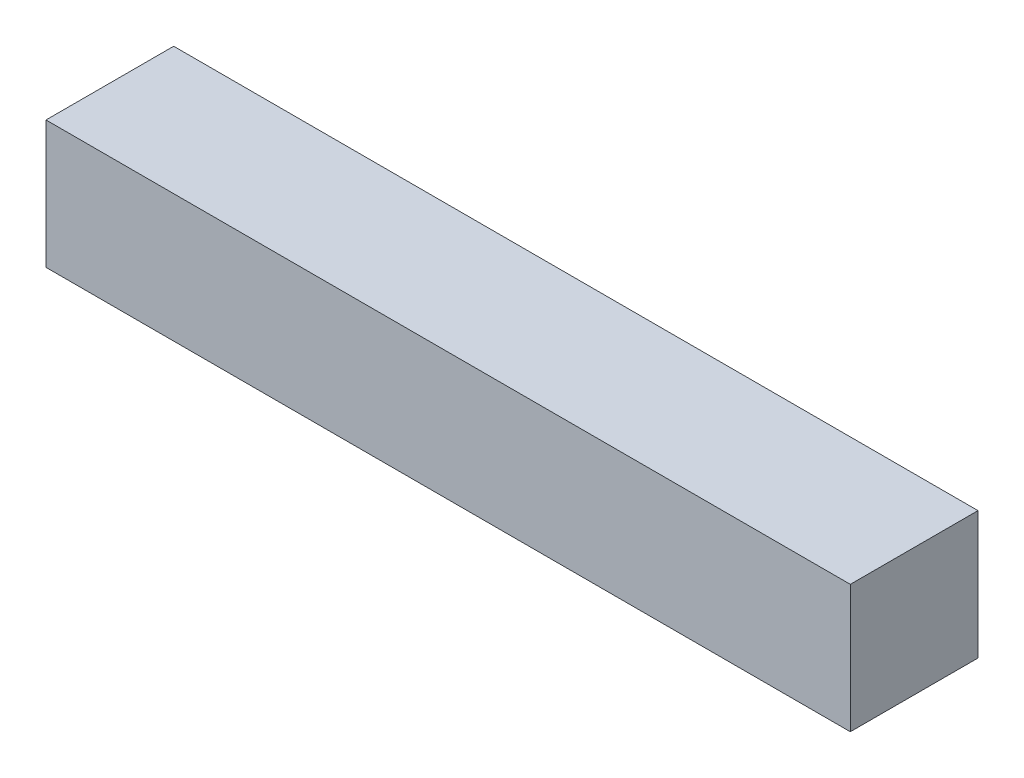
ISO-10303-21;
HEADER;
FILE_DESCRIPTION(('STEP AP214'),'2;1');
FILE_NAME('part.step','',(''),(''),'','','');
FILE_SCHEMA(('AUTOMOTIVE_DESIGN { 1 0 10303 214 1 1 1 1 }'));
ENDSEC;
DATA;
#1=APPLICATION_CONTEXT('core data for automotive mechanical design processes');
#2=APPLICATION_PROTOCOL_DEFINITION('international standard','automotive_design',2000,#1);
#3=PRODUCT_CONTEXT('',#1,'mechanical');
#4=PRODUCT('Part','Part','',(#3));
#5=PRODUCT_RELATED_PRODUCT_CATEGORY('part','',(#4));
#6=PRODUCT_DEFINITION_FORMATION('','',#4);
#7=PRODUCT_DEFINITION_CONTEXT('part definition',#1,'design');
#8=PRODUCT_DEFINITION('design','',#6,#7);
#9=PRODUCT_DEFINITION_SHAPE('','',#8);
#10=(LENGTH_UNIT() NAMED_UNIT(*) SI_UNIT(.MILLI.,.METRE.));
#11=(NAMED_UNIT(*) PLANE_ANGLE_UNIT() SI_UNIT($,.RADIAN.));
#12=(NAMED_UNIT(*) SI_UNIT($,.STERADIAN.) SOLID_ANGLE_UNIT());
#13=UNCERTAINTY_MEASURE_WITH_UNIT(LENGTH_MEASURE(1.E-05),#10,'distance_accuracy_value','');
#14=(GEOMETRIC_REPRESENTATION_CONTEXT(3) GLOBAL_UNCERTAINTY_ASSIGNED_CONTEXT((#13)) GLOBAL_UNIT_ASSIGNED_CONTEXT((#10,
#11,#12)) REPRESENTATION_CONTEXT('',''));
#15=CARTESIAN_POINT('',(0.,0.,0.));
#16=DIRECTION('',(0.,0.,1.));
#17=DIRECTION('',(1.,0.,0.));
#18=AXIS2_PLACEMENT_3D('',#15,#16,#17);
#19=CARTESIAN_POINT('',(-40.,12.7,-6.35));
#20=DIRECTION('',(1.,0.,0.));
#21=DIRECTION('',(0.,0.,-1.));
#22=AXIS2_PLACEMENT_3D('',#19,#20,#21);
#23=PLANE('',#22);
#24=DIRECTION('',(0.,0.,1.));
#25=VECTOR('',#24,1.);
#26=CARTESIAN_POINT('',(-40.,0.,-6.35));
#27=LINE('',#26,#25);
#28=CARTESIAN_POINT('',(-40.,0.,-6.35));
#29=VERTEX_POINT('',#28);
#30=CARTESIAN_POINT('',(-40.,0.,6.35));
#31=VERTEX_POINT('',#30);
#32=EDGE_CURVE('E100',#29,#31,#27,.T.);
#33=ORIENTED_EDGE('',*,*,#32,.T.);
#34=DIRECTION('',(0.,-1.,0.));
#35=VECTOR('',#34,1.);
#36=CARTESIAN_POINT('',(-40.,12.7,6.35));
#37=LINE('',#36,#35);
#38=CARTESIAN_POINT('',(-40.,12.7,6.35));
#39=VERTEX_POINT('',#38);
#40=EDGE_CURVE('E11',#39,#31,#37,.T.);
#41=ORIENTED_EDGE('',*,*,#40,.F.);
#42=DIRECTION('',(0.,0.,1.));
#43=VECTOR('',#42,1.);
#44=CARTESIAN_POINT('',(-40.,12.7,-6.35));
#45=LINE('',#44,#43);
#46=CARTESIAN_POINT('',(-40.,12.7,-6.35));
#47=VERTEX_POINT('',#46);
#48=EDGE_CURVE('E88',#47,#39,#45,.T.);
#49=ORIENTED_EDGE('',*,*,#48,.F.);
#50=DIRECTION('',(0.,-1.,0.));
#51=VECTOR('',#50,1.);
#52=CARTESIAN_POINT('',(-40.,12.7,-6.35));
#53=LINE('',#52,#51);
#54=EDGE_CURVE('E96',#47,#29,#53,.T.);
#55=ORIENTED_EDGE('',*,*,#54,.T.);
#56=EDGE_LOOP('',(#33,#41,#49,#55));
#57=FACE_BOUND('',#56,.T.);
#58=ADVANCED_FACE('F37',(#57),#23,.F.);
#59=CARTESIAN_POINT('',(-40.,12.7,6.35));
#60=DIRECTION('',(0.,0.,-1.));
#61=DIRECTION('',(-1.,0.,0.));
#62=AXIS2_PLACEMENT_3D('',#59,#60,#61);
#63=PLANE('',#62);
#64=DIRECTION('',(1.,0.,0.));
#65=VECTOR('',#64,1.);
#66=CARTESIAN_POINT('',(-40.,0.,6.35));
#67=LINE('',#66,#65);
#68=CARTESIAN_POINT('',(40.,0.,6.35));
#69=VERTEX_POINT('',#68);
#70=EDGE_CURVE('E92',#31,#69,#67,.T.);
#71=ORIENTED_EDGE('',*,*,#70,.T.);
#72=DIRECTION('',(0.,-1.,0.));
#73=VECTOR('',#72,1.);
#74=CARTESIAN_POINT('',(40.,12.7,6.35));
#75=LINE('',#74,#73);
#76=CARTESIAN_POINT('',(40.,12.7,6.35));
#77=VERTEX_POINT('',#76);
#78=EDGE_CURVE('E45',#77,#69,#75,.T.);
#79=ORIENTED_EDGE('',*,*,#78,.F.);
#80=DIRECTION('',(1.,0.,0.));
#81=VECTOR('',#80,1.);
#82=CARTESIAN_POINT('',(-40.,12.7,6.35));
#83=LINE('',#82,#81);
#84=EDGE_CURVE('E83',#39,#77,#83,.T.);
#85=ORIENTED_EDGE('',*,*,#84,.F.);
#86=ORIENTED_EDGE('',*,*,#40,.T.);
#87=EDGE_LOOP('',(#71,#79,#85,#86));
#88=FACE_BOUND('',#87,.T.);
#89=ADVANCED_FACE('F91',(#88),#63,.F.);
#90=CARTESIAN_POINT('',(40.,12.7,-6.35));
#91=DIRECTION('',(-1.,0.,0.));
#92=DIRECTION('',(0.,0.,1.));
#93=AXIS2_PLACEMENT_3D('',#90,#91,#92);
#94=PLANE('',#93);
#95=DIRECTION('',(0.,0.,-1.));
#96=VECTOR('',#95,1.);
#97=CARTESIAN_POINT('',(40.,0.,-6.35));
#98=LINE('',#97,#96);
#99=CARTESIAN_POINT('',(40.,0.,-6.35));
#100=VERTEX_POINT('',#99);
#101=EDGE_CURVE('E70',#69,#100,#98,.T.);
#102=ORIENTED_EDGE('',*,*,#101,.T.);
#103=DIRECTION('',(0.,-1.,0.));
#104=VECTOR('',#103,1.);
#105=CARTESIAN_POINT('',(40.,12.7,-6.35));
#106=LINE('',#105,#104);
#107=CARTESIAN_POINT('',(40.,12.7,-6.35));
#108=VERTEX_POINT('',#107);
#109=EDGE_CURVE('E93',#108,#100,#106,.T.);
#110=ORIENTED_EDGE('',*,*,#109,.F.);
#111=DIRECTION('',(0.,0.,-1.));
#112=VECTOR('',#111,1.);
#113=CARTESIAN_POINT('',(40.,12.7,-6.35));
#114=LINE('',#113,#112);
#115=EDGE_CURVE('E86',#77,#108,#114,.T.);
#116=ORIENTED_EDGE('',*,*,#115,.F.);
#117=ORIENTED_EDGE('',*,*,#78,.T.);
#118=EDGE_LOOP('',(#102,#110,#116,#117));
#119=FACE_BOUND('',#118,.T.);
#120=ADVANCED_FACE('F94',(#119),#94,.F.);
#121=CARTESIAN_POINT('',(-40.,12.7,-6.35));
#122=DIRECTION('',(0.,0.,1.));
#123=DIRECTION('',(1.,0.,0.));
#124=AXIS2_PLACEMENT_3D('',#121,#122,#123);
#125=PLANE('',#124);
#126=DIRECTION('',(-1.,0.,0.));
#127=VECTOR('',#126,1.);
#128=CARTESIAN_POINT('',(-40.,0.,-6.35));
#129=LINE('',#128,#127);
#130=EDGE_CURVE('E76',#100,#29,#129,.T.);
#131=ORIENTED_EDGE('',*,*,#130,.T.);
#132=ORIENTED_EDGE('',*,*,#54,.F.);
#133=DIRECTION('',(-1.,0.,0.));
#134=VECTOR('',#133,1.);
#135=CARTESIAN_POINT('',(-40.,12.7,-6.35));
#136=LINE('',#135,#134);
#137=EDGE_CURVE('E53',#108,#47,#136,.T.);
#138=ORIENTED_EDGE('',*,*,#137,.F.);
#139=ORIENTED_EDGE('',*,*,#109,.T.);
#140=EDGE_LOOP('',(#131,#132,#138,#139));
#141=FACE_BOUND('',#140,.T.);
#142=ADVANCED_FACE('F107',(#141),#125,.F.);
#143=CARTESIAN_POINT('',(0.,12.7,0.));
#144=DIRECTION('',(0.,1.,0.));
#145=DIRECTION('',(0.,0.,1.));
#146=AXIS2_PLACEMENT_3D('',#143,#144,#145);
#147=PLANE('',#146);
#148=ORIENTED_EDGE('',*,*,#48,.T.);
#149=ORIENTED_EDGE('',*,*,#84,.T.);
#150=ORIENTED_EDGE('',*,*,#115,.T.);
#151=ORIENTED_EDGE('',*,*,#137,.T.);
#152=EDGE_LOOP('',(#148,#149,#150,#151));
#153=FACE_BOUND('',#152,.T.);
#154=ADVANCED_FACE('F84',(#153),#147,.T.);
#155=CARTESIAN_POINT('',(0.,0.,0.));
#156=DIRECTION('',(0.,1.,0.));
#157=DIRECTION('',(0.,0.,1.));
#158=AXIS2_PLACEMENT_3D('',#155,#156,#157);
#159=PLANE('',#158);
#160=ORIENTED_EDGE('',*,*,#32,.F.);
#161=ORIENTED_EDGE('',*,*,#130,.F.);
#162=ORIENTED_EDGE('',*,*,#101,.F.);
#163=ORIENTED_EDGE('',*,*,#70,.F.);
#164=EDGE_LOOP('',(#160,#161,#162,#163));
#165=FACE_BOUND('',#164,.T.);
#166=ADVANCED_FACE('F110',(#165),#159,.F.);
#167=CLOSED_SHELL('',(#58,#89,#120,#142,#154,#166));
#168=MANIFOLD_SOLID_BREP('B2',#167);
#169=ADVANCED_BREP_SHAPE_REPRESENTATION('',(#18,#168),#14);
#170=SHAPE_DEFINITION_REPRESENTATION(#9,#169);
ENDSEC;
END-ISO-10303-21;
